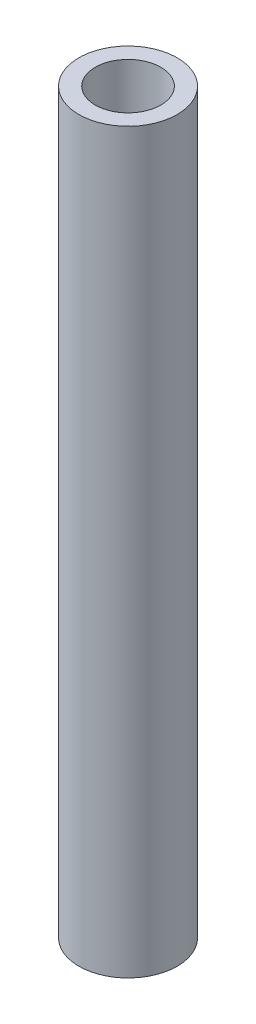
ISO-10303-21;
HEADER;
FILE_DESCRIPTION(('STEP AP214'),'2;1');
FILE_NAME('part.step','',(''),(''),'','','');
FILE_SCHEMA(('AUTOMOTIVE_DESIGN { 1 0 10303 214 1 1 1 1 }'));
ENDSEC;
DATA;
#1=APPLICATION_CONTEXT('core data for automotive mechanical design processes');
#2=APPLICATION_PROTOCOL_DEFINITION('international standard','automotive_design',2000,#1);
#3=PRODUCT_CONTEXT('',#1,'mechanical');
#4=PRODUCT('Part','Part','',(#3));
#5=PRODUCT_RELATED_PRODUCT_CATEGORY('part','',(#4));
#6=PRODUCT_DEFINITION_FORMATION('','',#4);
#7=PRODUCT_DEFINITION_CONTEXT('part definition',#1,'design');
#8=PRODUCT_DEFINITION('design','',#6,#7);
#9=PRODUCT_DEFINITION_SHAPE('','',#8);
#10=(LENGTH_UNIT() NAMED_UNIT(*) SI_UNIT(.MILLI.,.METRE.));
#11=(NAMED_UNIT(*) PLANE_ANGLE_UNIT() SI_UNIT($,.RADIAN.));
#12=(NAMED_UNIT(*) SI_UNIT($,.STERADIAN.) SOLID_ANGLE_UNIT());
#13=UNCERTAINTY_MEASURE_WITH_UNIT(LENGTH_MEASURE(1.E-05),#10,'distance_accuracy_value','');
#14=(GEOMETRIC_REPRESENTATION_CONTEXT(3) GLOBAL_UNCERTAINTY_ASSIGNED_CONTEXT((#13)) GLOBAL_UNIT_ASSIGNED_CONTEXT((#10,
#11,#12)) REPRESENTATION_CONTEXT('',''));
#15=CARTESIAN_POINT('',(0.,0.,0.));
#16=DIRECTION('',(0.,0.,1.));
#17=DIRECTION('',(1.,0.,0.));
#18=AXIS2_PLACEMENT_3D('',#15,#16,#17);
#19=CARTESIAN_POINT('',(0.,-22.5,0.));
#20=DIRECTION('',(0.,-1.,0.));
#21=DIRECTION('',(1.,0.,0.));
#22=AXIS2_PLACEMENT_3D('',#19,#20,#21);
#23=PLANE('',#22);
#24=CARTESIAN_POINT('',(0.,-22.5,0.));
#25=DIRECTION('',(0.,-1.,0.));
#26=DIRECTION('',(1.,0.,0.));
#27=AXIS2_PLACEMENT_3D('',#24,#25,#26);
#28=CIRCLE('',#27,3.00000000000001);
#29=CARTESIAN_POINT('',(3.00000000000001,-22.5,0.));
#30=VERTEX_POINT('',#29);
#31=EDGE_CURVE('E52',#30,#30,#28,.T.);
#32=ORIENTED_EDGE('',*,*,#31,.T.);
#33=EDGE_LOOP('',(#32));
#34=FACE_BOUND('',#33,.T.);
#35=CARTESIAN_POINT('',(0.,-22.5,0.));
#36=DIRECTION('',(0.,-1.,0.));
#37=DIRECTION('',(1.,0.,0.));
#38=AXIS2_PLACEMENT_3D('',#35,#36,#37);
#39=CIRCLE('',#38,2.);
#40=CARTESIAN_POINT('',(2.00000000000001,-22.5,0.));
#41=VERTEX_POINT('',#40);
#42=EDGE_CURVE('E10',#41,#41,#39,.T.);
#43=ORIENTED_EDGE('',*,*,#42,.F.);
#44=EDGE_LOOP('',(#43));
#45=FACE_BOUND('',#44,.T.);
#46=ADVANCED_FACE('F36',(#34,#45),#23,.T.);
#47=CARTESIAN_POINT('',(0.,-0.72021608418962,0.));
#48=DIRECTION('',(0.,-1.,0.));
#49=DIRECTION('',(1.,0.,0.));
#50=AXIS2_PLACEMENT_3D('',#47,#48,#49);
#51=CYLINDRICAL_SURFACE('',#50,2.);
#52=CARTESIAN_POINT('',(0.,22.5,0.));
#53=DIRECTION('',(0.,-1.,0.));
#54=DIRECTION('',(1.,0.,0.));
#55=AXIS2_PLACEMENT_3D('',#52,#53,#54);
#56=CIRCLE('',#55,2.);
#57=CARTESIAN_POINT('',(1.99999999999999,22.5,0.));
#58=VERTEX_POINT('',#57);
#59=EDGE_CURVE('E43',#58,#58,#56,.T.);
#60=ORIENTED_EDGE('',*,*,#59,.F.);
#61=EDGE_LOOP('',(#60));
#62=FACE_BOUND('',#61,.T.);
#63=ORIENTED_EDGE('',*,*,#42,.T.);
#64=EDGE_LOOP('',(#63));
#65=FACE_BOUND('',#64,.T.);
#66=ADVANCED_FACE('F68',(#62,#65),#51,.F.);
#67=CARTESIAN_POINT('',(0.,22.5,0.));
#68=DIRECTION('',(0.,-1.,0.));
#69=DIRECTION('',(1.,0.,0.));
#70=AXIS2_PLACEMENT_3D('',#67,#68,#69);
#71=PLANE('',#70);
#72=CARTESIAN_POINT('',(0.,22.5,0.));
#73=DIRECTION('',(0.,-1.,0.));
#74=DIRECTION('',(1.,0.,0.));
#75=AXIS2_PLACEMENT_3D('',#72,#73,#74);
#76=CIRCLE('',#75,3.);
#77=CARTESIAN_POINT('',(2.99999999999999,22.5,0.));
#78=VERTEX_POINT('',#77);
#79=EDGE_CURVE('E48',#78,#78,#76,.T.);
#80=ORIENTED_EDGE('',*,*,#79,.F.);
#81=EDGE_LOOP('',(#80));
#82=FACE_BOUND('',#81,.T.);
#83=ORIENTED_EDGE('',*,*,#59,.T.);
#84=EDGE_LOOP('',(#83));
#85=FACE_BOUND('',#84,.T.);
#86=ADVANCED_FACE('F62',(#82,#85),#71,.F.);
#87=CARTESIAN_POINT('',(0.,-0.72021608418962,0.));
#88=DIRECTION('',(0.,-1.,0.));
#89=DIRECTION('',(1.,0.,0.));
#90=AXIS2_PLACEMENT_3D('',#87,#88,#89);
#91=CYLINDRICAL_SURFACE('',#90,3.);
#92=ORIENTED_EDGE('',*,*,#79,.T.);
#93=EDGE_LOOP('',(#92));
#94=FACE_BOUND('',#93,.T.);
#95=ORIENTED_EDGE('',*,*,#31,.F.);
#96=EDGE_LOOP('',(#95));
#97=FACE_BOUND('',#96,.T.);
#98=ADVANCED_FACE('F60',(#94,#97),#91,.T.);
#99=CLOSED_SHELL('',(#46,#66,#86,#98));
#100=MANIFOLD_SOLID_BREP('B2',#99);
#101=ADVANCED_BREP_SHAPE_REPRESENTATION('',(#18,#100),#14);
#102=SHAPE_DEFINITION_REPRESENTATION(#9,#101);
ENDSEC;
END-ISO-10303-21;
